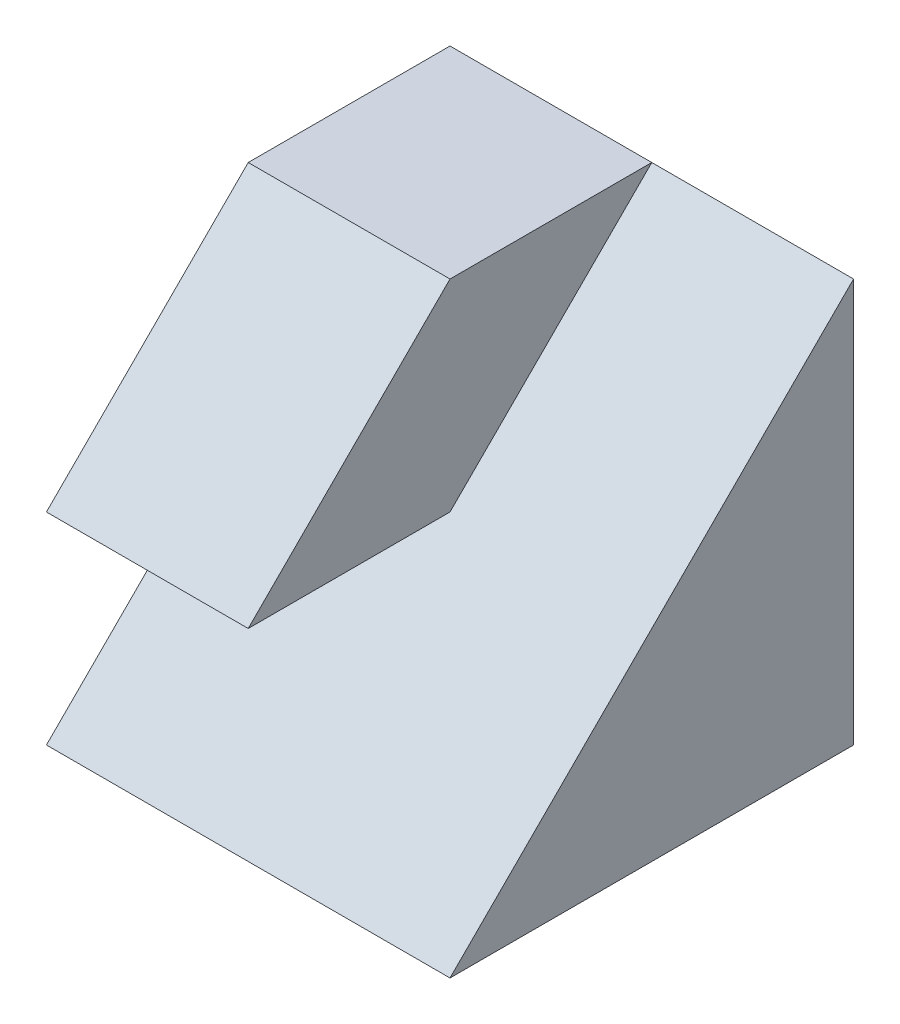
ISO-10303-21;
HEADER;
FILE_DESCRIPTION(('STEP AP214'),'2;1');
FILE_NAME('part.step','',(''),(''),'','','');
FILE_SCHEMA(('AUTOMOTIVE_DESIGN { 1 0 10303 214 1 1 1 1 }'));
ENDSEC;
DATA;
#1=APPLICATION_CONTEXT('core data for automotive mechanical design processes');
#2=APPLICATION_PROTOCOL_DEFINITION('international standard','automotive_design',2000,#1);
#3=PRODUCT_CONTEXT('',#1,'mechanical');
#4=PRODUCT('Part','Part','',(#3));
#5=PRODUCT_RELATED_PRODUCT_CATEGORY('part','',(#4));
#6=PRODUCT_DEFINITION_FORMATION('','',#4);
#7=PRODUCT_DEFINITION_CONTEXT('part definition',#1,'design');
#8=PRODUCT_DEFINITION('design','',#6,#7);
#9=PRODUCT_DEFINITION_SHAPE('','',#8);
#10=(LENGTH_UNIT() NAMED_UNIT(*) SI_UNIT(.MILLI.,.METRE.));
#11=(NAMED_UNIT(*) PLANE_ANGLE_UNIT() SI_UNIT($,.RADIAN.));
#12=(NAMED_UNIT(*) SI_UNIT($,.STERADIAN.) SOLID_ANGLE_UNIT());
#13=UNCERTAINTY_MEASURE_WITH_UNIT(LENGTH_MEASURE(1.E-05),#10,'distance_accuracy_value','');
#14=(GEOMETRIC_REPRESENTATION_CONTEXT(3) GLOBAL_UNCERTAINTY_ASSIGNED_CONTEXT((#13)) GLOBAL_UNIT_ASSIGNED_CONTEXT((#10,
#11,#12)) REPRESENTATION_CONTEXT('',''));
#15=CARTESIAN_POINT('',(0.,0.,0.));
#16=DIRECTION('',(0.,0.,1.));
#17=DIRECTION('',(1.,0.,0.));
#18=AXIS2_PLACEMENT_3D('',#15,#16,#17);
#19=CARTESIAN_POINT('',(2.,4.,2.));
#20=DIRECTION('',(-1.,0.,0.));
#21=DIRECTION('',(0.,0.,1.));
#22=AXIS2_PLACEMENT_3D('',#19,#20,#21);
#23=PLANE('',#22);
#24=DIRECTION('',(0.,-1.,0.));
#25=VECTOR('',#24,1.);
#26=CARTESIAN_POINT('',(2.,4.,-2.));
#27=LINE('',#26,#25);
#28=CARTESIAN_POINT('',(2.,4.,-2.));
#29=VERTEX_POINT('',#28);
#30=CARTESIAN_POINT('',(2.,0.,-2.));
#31=VERTEX_POINT('',#30);
#32=EDGE_CURVE('E59',#29,#31,#27,.T.);
#33=ORIENTED_EDGE('',*,*,#32,.F.);
#34=DIRECTION('',(0.,0.707106781186544,-0.707106781186551));
#35=VECTOR('',#34,1.);
#36=CARTESIAN_POINT('',(2.,1.99999999999998,0.));
#37=LINE('',#36,#35);
#38=CARTESIAN_POINT('',(2.,0.,2.));
#39=VERTEX_POINT('',#38);
#40=EDGE_CURVE('E116',#39,#29,#37,.T.);
#41=ORIENTED_EDGE('',*,*,#40,.F.);
#42=DIRECTION('',(0.,0.,-1.));
#43=VECTOR('',#42,1.);
#44=CARTESIAN_POINT('',(2.,0.,2.));
#45=LINE('',#44,#43);
#46=EDGE_CURVE('E99',#39,#31,#45,.T.);
#47=ORIENTED_EDGE('',*,*,#46,.T.);
#48=EDGE_LOOP('',(#33,#41,#47));
#49=FACE_BOUND('',#48,.T.);
#50=ADVANCED_FACE('F52',(#49),#23,.F.);
#51=CARTESIAN_POINT('',(-2.,4.,2.));
#52=DIRECTION('',(1.,0.,0.));
#53=DIRECTION('',(0.,0.,-1.));
#54=AXIS2_PLACEMENT_3D('',#51,#52,#53);
#55=PLANE('',#54);
#56=DIRECTION('',(0.,0.707106781186548,-0.707106781186548));
#57=VECTOR('',#56,1.);
#58=CARTESIAN_POINT('',(-2.,2.,2.));
#59=LINE('',#58,#57);
#60=CARTESIAN_POINT('',(-2.,1.99999999999999,2.));
#61=VERTEX_POINT('',#60);
#62=CARTESIAN_POINT('',(-2.,4.,0.));
#63=VERTEX_POINT('',#62);
#64=EDGE_CURVE('E137',#61,#63,#59,.T.);
#65=ORIENTED_EDGE('',*,*,#64,.T.);
#66=DIRECTION('',(0.,0.,1.));
#67=VECTOR('',#66,1.);
#68=CARTESIAN_POINT('',(-2.,4.,2.));
#69=LINE('',#68,#67);
#70=CARTESIAN_POINT('',(-2.,4.,-2.));
#71=VERTEX_POINT('',#70);
#72=EDGE_CURVE('E107',#71,#63,#69,.T.);
#73=ORIENTED_EDGE('',*,*,#72,.F.);
#74=DIRECTION('',(0.,-1.,0.));
#75=VECTOR('',#74,1.);
#76=CARTESIAN_POINT('',(-2.,4.,-2.));
#77=LINE('',#76,#75);
#78=CARTESIAN_POINT('',(-2.,0.,-2.));
#79=VERTEX_POINT('',#78);
#80=EDGE_CURVE('E90',#71,#79,#77,.T.);
#81=ORIENTED_EDGE('',*,*,#80,.T.);
#82=DIRECTION('',(0.,0.,1.));
#83=VECTOR('',#82,1.);
#84=CARTESIAN_POINT('',(-2.,0.,2.));
#85=LINE('',#84,#83);
#86=CARTESIAN_POINT('',(-2.,0.,2.));
#87=VERTEX_POINT('',#86);
#88=EDGE_CURVE('E98',#79,#87,#85,.T.);
#89=ORIENTED_EDGE('',*,*,#88,.T.);
#90=DIRECTION('',(0.,0.707106781186544,-0.707106781186551));
#91=VECTOR('',#90,1.);
#92=CARTESIAN_POINT('',(-2.,1.,0.999999999999989));
#93=LINE('',#92,#91);
#94=CARTESIAN_POINT('',(-2.,1.99999999999998,0.));
#95=VERTEX_POINT('',#94);
#96=EDGE_CURVE('E127',#87,#95,#93,.T.);
#97=ORIENTED_EDGE('',*,*,#96,.T.);
#98=DIRECTION('',(0.,0.,1.));
#99=VECTOR('',#98,1.);
#100=CARTESIAN_POINT('',(-2.,1.99999999999998,0.));
#101=LINE('',#100,#99);
#102=EDGE_CURVE('E131',#95,#61,#101,.T.);
#103=ORIENTED_EDGE('',*,*,#102,.T.);
#104=EDGE_LOOP('',(#65,#73,#81,#89,#97,#103));
#105=FACE_BOUND('',#104,.T.);
#106=ADVANCED_FACE('F104',(#105),#55,.F.);
#107=CARTESIAN_POINT('',(0.,4.,0.));
#108=DIRECTION('',(0.,-1.,0.));
#109=DIRECTION('',(0.,0.,-1.));
#110=AXIS2_PLACEMENT_3D('',#107,#108,#109);
#111=PLANE('',#110);
#112=DIRECTION('',(-1.,0.,0.));
#113=VECTOR('',#112,1.);
#114=CARTESIAN_POINT('',(8.,4.,0.));
#115=LINE('',#114,#113);
#116=CARTESIAN_POINT('',(0.,4.,0.));
#117=VERTEX_POINT('',#116);
#118=EDGE_CURVE('E134',#117,#63,#115,.T.);
#119=ORIENTED_EDGE('',*,*,#118,.F.);
#120=DIRECTION('',(0.,0.,-1.));
#121=VECTOR('',#120,1.);
#122=CARTESIAN_POINT('',(0.,4.,0.));
#123=LINE('',#122,#121);
#124=CARTESIAN_POINT('',(0.,4.,-2.));
#125=VERTEX_POINT('',#124);
#126=EDGE_CURVE('E65',#117,#125,#123,.T.);
#127=ORIENTED_EDGE('',*,*,#126,.T.);
#128=DIRECTION('',(-1.,0.,0.));
#129=VECTOR('',#128,1.);
#130=CARTESIAN_POINT('',(-2.,4.,-2.));
#131=LINE('',#130,#129);
#132=EDGE_CURVE('E73',#125,#71,#131,.T.);
#133=ORIENTED_EDGE('',*,*,#132,.T.);
#134=ORIENTED_EDGE('',*,*,#72,.T.);
#135=EDGE_LOOP('',(#119,#127,#133,#134));
#136=FACE_BOUND('',#135,.T.);
#137=ADVANCED_FACE('F157',(#136),#111,.F.);
#138=CARTESIAN_POINT('',(-2.,4.,-2.));
#139=DIRECTION('',(0.,0.,1.));
#140=DIRECTION('',(1.,0.,0.));
#141=AXIS2_PLACEMENT_3D('',#138,#139,#140);
#142=PLANE('',#141);
#143=DIRECTION('',(-1.,0.,0.));
#144=VECTOR('',#143,1.);
#145=CARTESIAN_POINT('',(-2.,0.,-2.));
#146=LINE('',#145,#144);
#147=EDGE_CURVE('E87',#31,#79,#146,.T.);
#148=ORIENTED_EDGE('',*,*,#147,.T.);
#149=ORIENTED_EDGE('',*,*,#80,.F.);
#150=ORIENTED_EDGE('',*,*,#132,.F.);
#151=EDGE_CURVE('E118',#29,#125,#131,.T.);
#152=ORIENTED_EDGE('',*,*,#151,.F.);
#153=ORIENTED_EDGE('',*,*,#32,.T.);
#154=EDGE_LOOP('',(#148,#149,#150,#152,#153));
#155=FACE_BOUND('',#154,.T.);
#156=ADVANCED_FACE('F89',(#155),#142,.F.);
#157=CARTESIAN_POINT('',(0.,0.,0.));
#158=DIRECTION('',(0.,-1.,0.));
#159=DIRECTION('',(0.,0.,-1.));
#160=AXIS2_PLACEMENT_3D('',#157,#158,#159);
#161=PLANE('',#160);
#162=ORIENTED_EDGE('',*,*,#46,.F.);
#163=DIRECTION('',(1.,0.,0.));
#164=VECTOR('',#163,1.);
#165=CARTESIAN_POINT('',(-2.,0.,2.));
#166=LINE('',#165,#164);
#167=EDGE_CURVE('E111',#87,#39,#166,.T.);
#168=ORIENTED_EDGE('',*,*,#167,.F.);
#169=ORIENTED_EDGE('',*,*,#88,.F.);
#170=ORIENTED_EDGE('',*,*,#147,.F.);
#171=EDGE_LOOP('',(#162,#168,#169,#170));
#172=FACE_BOUND('',#171,.T.);
#173=ADVANCED_FACE('F109',(#172),#161,.T.);
#174=CARTESIAN_POINT('',(8.,1.99999999999998,0.));
#175=DIRECTION('',(0.,-1.,0.));
#176=DIRECTION('',(0.,0.,-1.));
#177=AXIS2_PLACEMENT_3D('',#174,#175,#176);
#178=PLANE('',#177);
#179=DIRECTION('',(0.,0.,-1.));
#180=VECTOR('',#179,1.);
#181=CARTESIAN_POINT('',(0.,1.99999999999998,0.));
#182=LINE('',#181,#180);
#183=CARTESIAN_POINT('',(0.,2.,2.));
#184=VERTEX_POINT('',#183);
#185=CARTESIAN_POINT('',(0.,1.99999999999999,0.));
#186=VERTEX_POINT('',#185);
#187=EDGE_CURVE('E140',#184,#186,#182,.T.);
#188=ORIENTED_EDGE('',*,*,#187,.F.);
#189=DIRECTION('',(-1.,0.,0.));
#190=VECTOR('',#189,1.);
#191=CARTESIAN_POINT('',(8.,1.99999999999999,2.));
#192=LINE('',#191,#190);
#193=EDGE_CURVE('E123',#184,#61,#192,.T.);
#194=ORIENTED_EDGE('',*,*,#193,.T.);
#195=ORIENTED_EDGE('',*,*,#102,.F.);
#196=DIRECTION('',(-1.,0.,0.));
#197=VECTOR('',#196,1.);
#198=CARTESIAN_POINT('',(8.,1.99999999999998,0.));
#199=LINE('',#198,#197);
#200=EDGE_CURVE('E124',#186,#95,#199,.T.);
#201=ORIENTED_EDGE('',*,*,#200,.F.);
#202=EDGE_LOOP('',(#188,#194,#195,#201));
#203=FACE_BOUND('',#202,.T.);
#204=ADVANCED_FACE('F168',(#203),#178,.T.);
#205=CARTESIAN_POINT('',(8.,1.,0.999999999999989));
#206=DIRECTION('',(0.,0.707106781186551,0.707106781186544));
#207=DIRECTION('',(0.,-0.707106781186544,0.707106781186551));
#208=AXIS2_PLACEMENT_3D('',#205,#206,#207);
#209=PLANE('',#208);
#210=ORIENTED_EDGE('',*,*,#167,.T.);
#211=ORIENTED_EDGE('',*,*,#40,.T.);
#212=ORIENTED_EDGE('',*,*,#151,.T.);
#213=DIRECTION('',(0.,0.707106781186548,-0.707106781186548));
#214=VECTOR('',#213,1.);
#215=CARTESIAN_POINT('',(0.,0.,2.));
#216=LINE('',#215,#214);
#217=EDGE_CURVE('E143',#186,#125,#216,.T.);
#218=ORIENTED_EDGE('',*,*,#217,.F.);
#219=ORIENTED_EDGE('',*,*,#200,.T.);
#220=ORIENTED_EDGE('',*,*,#96,.F.);
#221=EDGE_LOOP('',(#210,#211,#212,#218,#219,#220));
#222=FACE_BOUND('',#221,.T.);
#223=ADVANCED_FACE('F154',(#222),#209,.T.);
#224=CARTESIAN_POINT('',(8.,2.,2.));
#225=DIRECTION('',(0.,0.707106781186548,0.707106781186548));
#226=DIRECTION('',(0.,-0.707106781186548,0.707106781186548));
#227=AXIS2_PLACEMENT_3D('',#224,#225,#226);
#228=PLANE('',#227);
#229=DIRECTION('',(0.,-0.707106781186548,0.707106781186548));
#230=VECTOR('',#229,1.);
#231=CARTESIAN_POINT('',(0.,2.,2.));
#232=LINE('',#231,#230);
#233=EDGE_CURVE('E12',#117,#184,#232,.T.);
#234=ORIENTED_EDGE('',*,*,#233,.F.);
#235=ORIENTED_EDGE('',*,*,#118,.T.);
#236=ORIENTED_EDGE('',*,*,#64,.F.);
#237=ORIENTED_EDGE('',*,*,#193,.F.);
#238=EDGE_LOOP('',(#234,#235,#236,#237));
#239=FACE_BOUND('',#238,.T.);
#240=ADVANCED_FACE('F161',(#239),#228,.T.);
#241=CARTESIAN_POINT('',(0.,0.,0.));
#242=DIRECTION('',(-1.,0.,0.));
#243=DIRECTION('',(0.,0.,1.));
#244=AXIS2_PLACEMENT_3D('',#241,#242,#243);
#245=PLANE('',#244);
#246=ORIENTED_EDGE('',*,*,#233,.T.);
#247=ORIENTED_EDGE('',*,*,#187,.T.);
#248=ORIENTED_EDGE('',*,*,#217,.T.);
#249=ORIENTED_EDGE('',*,*,#126,.F.);
#250=EDGE_LOOP('',(#246,#247,#248,#249));
#251=FACE_BOUND('',#250,.T.);
#252=ADVANCED_FACE('F146',(#251),#245,.F.);
#253=CLOSED_SHELL('',(#50,#106,#137,#156,#173,#204,#223,#240,#252));
#254=MANIFOLD_SOLID_BREP('B2',#253);
#255=ADVANCED_BREP_SHAPE_REPRESENTATION('',(#18,#254),#14);
#256=SHAPE_DEFINITION_REPRESENTATION(#9,#255);
ENDSEC;
END-ISO-10303-21;
